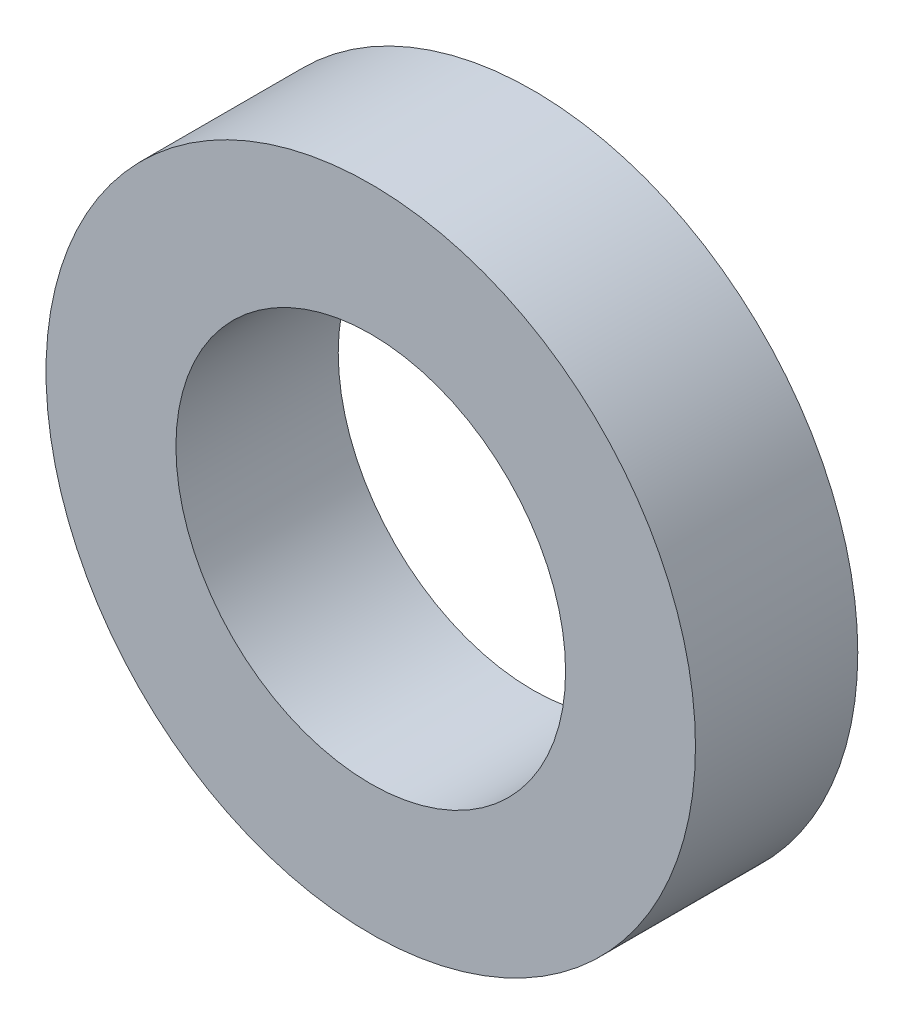
ISO-10303-21;
HEADER;
FILE_DESCRIPTION(('STEP AP214'),'2;1');
FILE_NAME('part.step','',(''),(''),'','','');
FILE_SCHEMA(('AUTOMOTIVE_DESIGN { 1 0 10303 214 1 1 1 1 }'));
ENDSEC;
DATA;
#1=APPLICATION_CONTEXT('core data for automotive mechanical design processes');
#2=APPLICATION_PROTOCOL_DEFINITION('international standard','automotive_design',2000,#1);
#3=PRODUCT_CONTEXT('',#1,'mechanical');
#4=PRODUCT('Part','Part','',(#3));
#5=PRODUCT_RELATED_PRODUCT_CATEGORY('part','',(#4));
#6=PRODUCT_DEFINITION_FORMATION('','',#4);
#7=PRODUCT_DEFINITION_CONTEXT('part definition',#1,'design');
#8=PRODUCT_DEFINITION('design','',#6,#7);
#9=PRODUCT_DEFINITION_SHAPE('','',#8);
#10=(LENGTH_UNIT() NAMED_UNIT(*) SI_UNIT(.MILLI.,.METRE.));
#11=(NAMED_UNIT(*) PLANE_ANGLE_UNIT() SI_UNIT($,.RADIAN.));
#12=(NAMED_UNIT(*) SI_UNIT($,.STERADIAN.) SOLID_ANGLE_UNIT());
#13=UNCERTAINTY_MEASURE_WITH_UNIT(LENGTH_MEASURE(1.E-05),#10,'distance_accuracy_value','');
#14=(GEOMETRIC_REPRESENTATION_CONTEXT(3) GLOBAL_UNCERTAINTY_ASSIGNED_CONTEXT((#13)) GLOBAL_UNIT_ASSIGNED_CONTEXT((#10,
#11,#12)) REPRESENTATION_CONTEXT('',''));
#15=CARTESIAN_POINT('',(0.,0.,0.));
#16=DIRECTION('',(0.,0.,1.));
#17=DIRECTION('',(1.,0.,0.));
#18=AXIS2_PLACEMENT_3D('',#15,#16,#17);
#19=CARTESIAN_POINT('',(0.,0.,3.96748));
#20=DIRECTION('',(0.,0.,1.));
#21=DIRECTION('',(1.,0.,0.));
#22=AXIS2_PLACEMENT_3D('',#19,#20,#21);
#23=PLANE('',#22);
#24=CARTESIAN_POINT('',(0.,0.,3.96748));
#25=DIRECTION('',(0.,0.,1.));
#26=DIRECTION('',(1.,0.,0.));
#27=AXIS2_PLACEMENT_3D('',#24,#25,#26);
#28=CIRCLE('',#27,7.9375);
#29=CARTESIAN_POINT('',(7.9375,0.,3.96748));
#30=VERTEX_POINT('',#29);
#31=EDGE_CURVE('E10',#30,#30,#28,.T.);
#32=ORIENTED_EDGE('',*,*,#31,.T.);
#33=EDGE_LOOP('',(#32));
#34=FACE_BOUND('',#33,.T.);
#35=CARTESIAN_POINT('',(0.,0.,3.96748));
#36=DIRECTION('',(0.,0.,1.));
#37=DIRECTION('',(1.,0.,0.));
#38=AXIS2_PLACEMENT_3D('',#35,#36,#37);
#39=CIRCLE('',#38,4.7625);
#40=CARTESIAN_POINT('',(4.7625,0.,3.96748));
#41=VERTEX_POINT('',#40);
#42=EDGE_CURVE('E42',#41,#41,#39,.T.);
#43=ORIENTED_EDGE('',*,*,#42,.F.);
#44=EDGE_LOOP('',(#43));
#45=FACE_BOUND('',#44,.T.);
#46=ADVANCED_FACE('F31',(#34,#45),#23,.T.);
#47=CARTESIAN_POINT('',(0.,0.,0.));
#48=DIRECTION('',(0.,0.,1.));
#49=DIRECTION('',(1.,0.,0.));
#50=AXIS2_PLACEMENT_3D('',#47,#48,#49);
#51=PLANE('',#50);
#52=CARTESIAN_POINT('',(0.,0.,0.));
#53=DIRECTION('',(0.,0.,1.));
#54=DIRECTION('',(1.,0.,0.));
#55=AXIS2_PLACEMENT_3D('',#52,#53,#54);
#56=CIRCLE('',#55,7.9375);
#57=CARTESIAN_POINT('',(7.9375,0.,0.));
#58=VERTEX_POINT('',#57);
#59=EDGE_CURVE('E35',#58,#58,#56,.T.);
#60=ORIENTED_EDGE('',*,*,#59,.F.);
#61=EDGE_LOOP('',(#60));
#62=FACE_BOUND('',#61,.T.);
#63=CARTESIAN_POINT('',(0.,0.,0.));
#64=DIRECTION('',(0.,0.,1.));
#65=DIRECTION('',(1.,0.,0.));
#66=AXIS2_PLACEMENT_3D('',#63,#64,#65);
#67=CIRCLE('',#66,4.7625);
#68=CARTESIAN_POINT('',(4.7625,0.,0.));
#69=VERTEX_POINT('',#68);
#70=EDGE_CURVE('E44',#69,#69,#67,.T.);
#71=ORIENTED_EDGE('',*,*,#70,.T.);
#72=EDGE_LOOP('',(#71));
#73=FACE_BOUND('',#72,.T.);
#74=ADVANCED_FACE('F54',(#62,#73),#51,.F.);
#75=CARTESIAN_POINT('',(0.,0.,3.96748));
#76=DIRECTION('',(0.,0.,-1.));
#77=DIRECTION('',(-1.,0.,0.));
#78=AXIS2_PLACEMENT_3D('',#75,#76,#77);
#79=CYLINDRICAL_SURFACE('',#78,7.9375);
#80=ORIENTED_EDGE('',*,*,#31,.F.);
#81=EDGE_LOOP('',(#80));
#82=FACE_BOUND('',#81,.T.);
#83=ORIENTED_EDGE('',*,*,#59,.T.);
#84=EDGE_LOOP('',(#83));
#85=FACE_BOUND('',#84,.T.);
#86=ADVANCED_FACE('F33',(#82,#85),#79,.T.);
#87=CARTESIAN_POINT('',(0.,0.,3.96748));
#88=DIRECTION('',(0.,0.,-1.));
#89=DIRECTION('',(-1.,0.,0.));
#90=AXIS2_PLACEMENT_3D('',#87,#88,#89);
#91=CYLINDRICAL_SURFACE('',#90,4.7625);
#92=ORIENTED_EDGE('',*,*,#42,.T.);
#93=EDGE_LOOP('',(#92));
#94=FACE_BOUND('',#93,.T.);
#95=ORIENTED_EDGE('',*,*,#70,.F.);
#96=EDGE_LOOP('',(#95));
#97=FACE_BOUND('',#96,.T.);
#98=ADVANCED_FACE('F50',(#94,#97),#91,.F.);
#99=CLOSED_SHELL('',(#46,#74,#86,#98));
#100=MANIFOLD_SOLID_BREP('B2',#99);
#101=ADVANCED_BREP_SHAPE_REPRESENTATION('',(#18,#100),#14);
#102=SHAPE_DEFINITION_REPRESENTATION(#9,#101);
ENDSEC;
END-ISO-10303-21;
